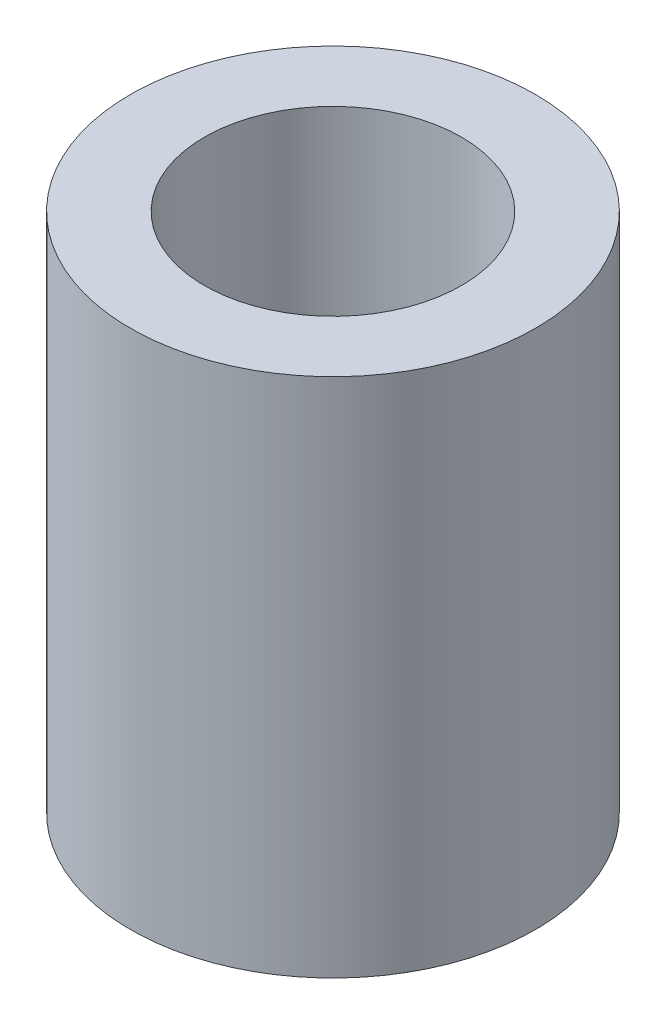
ISO-10303-21;
HEADER;
FILE_DESCRIPTION(('STEP AP214'),'2;1');
FILE_NAME('part.step','',(''),(''),'','','');
FILE_SCHEMA(('AUTOMOTIVE_DESIGN { 1 0 10303 214 1 1 1 1 }'));
ENDSEC;
DATA;
#1=APPLICATION_CONTEXT('core data for automotive mechanical design processes');
#2=APPLICATION_PROTOCOL_DEFINITION('international standard','automotive_design',2000,#1);
#3=PRODUCT_CONTEXT('',#1,'mechanical');
#4=PRODUCT('Part','Part','',(#3));
#5=PRODUCT_RELATED_PRODUCT_CATEGORY('part','',(#4));
#6=PRODUCT_DEFINITION_FORMATION('','',#4);
#7=PRODUCT_DEFINITION_CONTEXT('part definition',#1,'design');
#8=PRODUCT_DEFINITION('design','',#6,#7);
#9=PRODUCT_DEFINITION_SHAPE('','',#8);
#10=(LENGTH_UNIT() NAMED_UNIT(*) SI_UNIT(.MILLI.,.METRE.));
#11=(NAMED_UNIT(*) PLANE_ANGLE_UNIT() SI_UNIT($,.RADIAN.));
#12=(NAMED_UNIT(*) SI_UNIT($,.STERADIAN.) SOLID_ANGLE_UNIT());
#13=UNCERTAINTY_MEASURE_WITH_UNIT(LENGTH_MEASURE(1.E-05),#10,'distance_accuracy_value','');
#14=(GEOMETRIC_REPRESENTATION_CONTEXT(3) GLOBAL_UNCERTAINTY_ASSIGNED_CONTEXT((#13)) GLOBAL_UNIT_ASSIGNED_CONTEXT((#10,
#11,#12)) REPRESENTATION_CONTEXT('',''));
#15=CARTESIAN_POINT('',(0.,0.,0.));
#16=DIRECTION('',(0.,0.,1.));
#17=DIRECTION('',(1.,0.,0.));
#18=AXIS2_PLACEMENT_3D('',#15,#16,#17);
#19=CARTESIAN_POINT('',(2.,8.1,0.));
#20=DIRECTION('',(0.,1.,0.));
#21=DIRECTION('',(0.,0.,1.));
#22=AXIS2_PLACEMENT_3D('',#19,#20,#21);
#23=PLANE('',#22);
#24=CARTESIAN_POINT('',(0.,8.1,0.));
#25=DIRECTION('',(0.,-1.,0.));
#26=DIRECTION('',(0.,0.,-1.));
#27=AXIS2_PLACEMENT_3D('',#24,#25,#26);
#28=CIRCLE('',#27,2.);
#29=CARTESIAN_POINT('',(0.,8.1,-2.));
#30=VERTEX_POINT('',#29);
#31=EDGE_CURVE('E51',#30,#30,#28,.T.);
#32=ORIENTED_EDGE('',*,*,#31,.T.);
#33=EDGE_LOOP('',(#32));
#34=FACE_BOUND('',#33,.T.);
#35=CARTESIAN_POINT('',(0.,8.1,0.));
#36=DIRECTION('',(0.,-1.,0.));
#37=DIRECTION('',(0.,0.,-1.));
#38=AXIS2_PLACEMENT_3D('',#35,#36,#37);
#39=CIRCLE('',#38,3.15);
#40=CARTESIAN_POINT('',(0.,8.1,-3.15));
#41=VERTEX_POINT('',#40);
#42=EDGE_CURVE('E10',#41,#41,#39,.T.);
#43=ORIENTED_EDGE('',*,*,#42,.F.);
#44=EDGE_LOOP('',(#43));
#45=FACE_BOUND('',#44,.T.);
#46=ADVANCED_FACE('F37',(#34,#45),#23,.T.);
#47=CARTESIAN_POINT('',(0.,0.,0.));
#48=DIRECTION('',(0.,-1.,0.));
#49=DIRECTION('',(0.,0.,-1.));
#50=AXIS2_PLACEMENT_3D('',#47,#48,#49);
#51=CYLINDRICAL_SURFACE('',#50,3.15);
#52=ORIENTED_EDGE('',*,*,#42,.T.);
#53=EDGE_LOOP('',(#52));
#54=FACE_BOUND('',#53,.T.);
#55=CARTESIAN_POINT('',(0.,0.,0.));
#56=DIRECTION('',(0.,-1.,0.));
#57=DIRECTION('',(0.,0.,-1.));
#58=AXIS2_PLACEMENT_3D('',#55,#56,#57);
#59=CIRCLE('',#58,3.15);
#60=CARTESIAN_POINT('',(0.,0.,-3.15));
#61=VERTEX_POINT('',#60);
#62=EDGE_CURVE('E43',#61,#61,#59,.T.);
#63=ORIENTED_EDGE('',*,*,#62,.F.);
#64=EDGE_LOOP('',(#63));
#65=FACE_BOUND('',#64,.T.);
#66=ADVANCED_FACE('F67',(#54,#65),#51,.T.);
#67=CARTESIAN_POINT('',(3.15,0.,0.));
#68=DIRECTION('',(0.,-1.,0.));
#69=DIRECTION('',(0.,0.,-1.));
#70=AXIS2_PLACEMENT_3D('',#67,#68,#69);
#71=PLANE('',#70);
#72=ORIENTED_EDGE('',*,*,#62,.T.);
#73=EDGE_LOOP('',(#72));
#74=FACE_BOUND('',#73,.T.);
#75=CARTESIAN_POINT('',(0.,0.,0.));
#76=DIRECTION('',(0.,-1.,0.));
#77=DIRECTION('',(0.,0.,-1.));
#78=AXIS2_PLACEMENT_3D('',#75,#76,#77);
#79=CIRCLE('',#78,2.);
#80=CARTESIAN_POINT('',(0.,0.,-2.));
#81=VERTEX_POINT('',#80);
#82=EDGE_CURVE('E47',#81,#81,#79,.T.);
#83=ORIENTED_EDGE('',*,*,#82,.F.);
#84=EDGE_LOOP('',(#83));
#85=FACE_BOUND('',#84,.T.);
#86=ADVANCED_FACE('F61',(#74,#85),#71,.T.);
#87=CARTESIAN_POINT('',(0.,0.,0.));
#88=DIRECTION('',(0.,-1.,0.));
#89=DIRECTION('',(0.,0.,-1.));
#90=AXIS2_PLACEMENT_3D('',#87,#88,#89);
#91=CYLINDRICAL_SURFACE('',#90,2.);
#92=ORIENTED_EDGE('',*,*,#82,.T.);
#93=EDGE_LOOP('',(#92));
#94=FACE_BOUND('',#93,.T.);
#95=ORIENTED_EDGE('',*,*,#31,.F.);
#96=EDGE_LOOP('',(#95));
#97=FACE_BOUND('',#96,.T.);
#98=ADVANCED_FACE('F59',(#94,#97),#91,.F.);
#99=CLOSED_SHELL('',(#46,#66,#86,#98));
#100=MANIFOLD_SOLID_BREP('B2',#99);
#101=ADVANCED_BREP_SHAPE_REPRESENTATION('',(#18,#100),#14);
#102=SHAPE_DEFINITION_REPRESENTATION(#9,#101);
ENDSEC;
END-ISO-10303-21;
